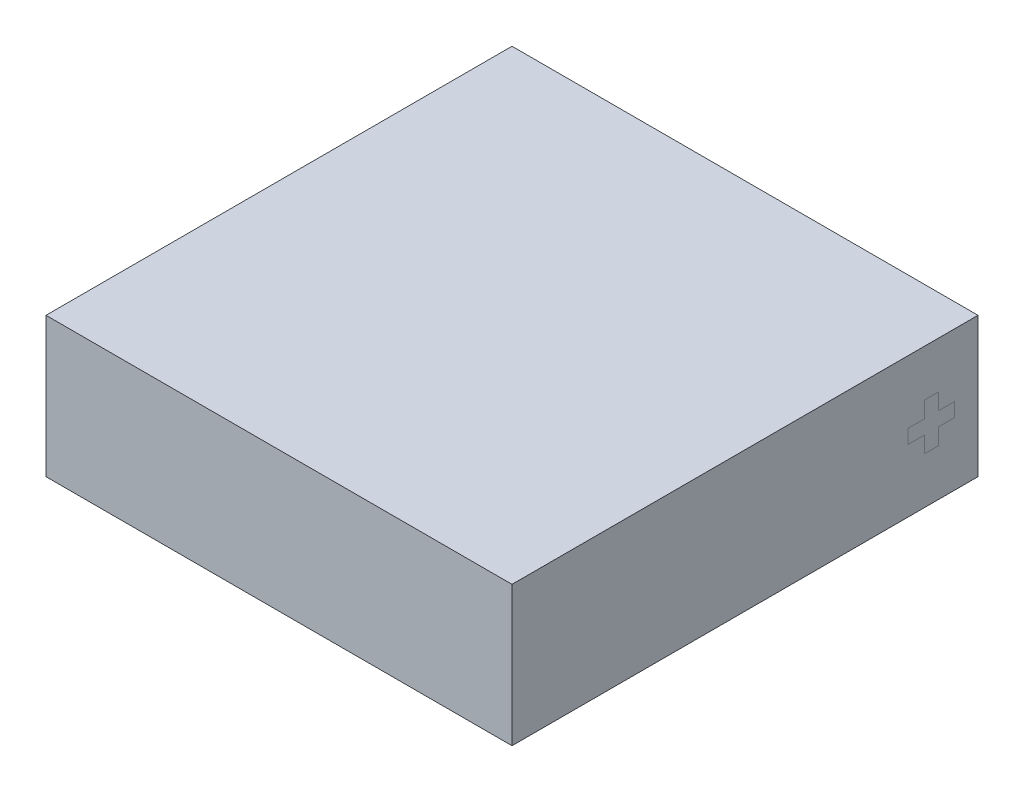
ISO-10303-21;
HEADER;
FILE_DESCRIPTION(('STEP AP214'),'2;1');
FILE_NAME('part.step','',(''),(''),'','','');
FILE_SCHEMA(('AUTOMOTIVE_DESIGN { 1 0 10303 214 1 1 1 1 }'));
ENDSEC;
DATA;
#1=APPLICATION_CONTEXT('core data for automotive mechanical design processes');
#2=APPLICATION_PROTOCOL_DEFINITION('international standard','automotive_design',2000,#1);
#3=PRODUCT_CONTEXT('',#1,'mechanical');
#4=PRODUCT('Part','Part','',(#3));
#5=PRODUCT_RELATED_PRODUCT_CATEGORY('part','',(#4));
#6=PRODUCT_DEFINITION_FORMATION('','',#4);
#7=PRODUCT_DEFINITION_CONTEXT('part definition',#1,'design');
#8=PRODUCT_DEFINITION('design','',#6,#7);
#9=PRODUCT_DEFINITION_SHAPE('','',#8);
#10=(LENGTH_UNIT() NAMED_UNIT(*) SI_UNIT(.MILLI.,.METRE.));
#11=(NAMED_UNIT(*) PLANE_ANGLE_UNIT() SI_UNIT($,.RADIAN.));
#12=(NAMED_UNIT(*) SI_UNIT($,.STERADIAN.) SOLID_ANGLE_UNIT());
#13=UNCERTAINTY_MEASURE_WITH_UNIT(LENGTH_MEASURE(1.E-05),#10,'distance_accuracy_value','');
#14=(GEOMETRIC_REPRESENTATION_CONTEXT(3) GLOBAL_UNCERTAINTY_ASSIGNED_CONTEXT((#13)) GLOBAL_UNIT_ASSIGNED_CONTEXT((#10,
#11,#12)) REPRESENTATION_CONTEXT('',''));
#15=CARTESIAN_POINT('',(0.,0.,0.));
#16=DIRECTION('',(0.,0.,1.));
#17=DIRECTION('',(1.,0.,0.));
#18=AXIS2_PLACEMENT_3D('',#15,#16,#17);
#19=CARTESIAN_POINT('',(5.,3.,-5.));
#20=DIRECTION('',(-1.,0.,0.));
#21=DIRECTION('',(0.,0.,1.));
#22=AXIS2_PLACEMENT_3D('',#19,#20,#21);
#23=PLANE('',#22);
#24=DIRECTION('',(0.,1.,0.));
#25=VECTOR('',#24,1.);
#26=CARTESIAN_POINT('',(5.,1.35,-4.15));
#27=LINE('',#26,#25);
#28=CARTESIAN_POINT('',(5.,0.999999999999999,-4.15));
#29=VERTEX_POINT('',#28);
#30=CARTESIAN_POINT('',(5.,1.35,-4.15));
#31=VERTEX_POINT('',#30);
#32=EDGE_CURVE('E445',#29,#31,#27,.T.);
#33=ORIENTED_EDGE('',*,*,#32,.T.);
#34=DIRECTION('',(0.,0.,-1.));
#35=VECTOR('',#34,1.);
#36=CARTESIAN_POINT('',(5.,1.35,-4.15));
#37=LINE('',#36,#35);
#38=CARTESIAN_POINT('',(5.,1.35,-4.5));
#39=VERTEX_POINT('',#38);
#40=EDGE_CURVE('E13',#31,#39,#37,.T.);
#41=ORIENTED_EDGE('',*,*,#40,.T.);
#42=DIRECTION('',(0.,1.,0.));
#43=VECTOR('',#42,1.);
#44=CARTESIAN_POINT('',(5.,1.65,-4.5));
#45=LINE('',#44,#43);
#46=CARTESIAN_POINT('',(5.,1.65,-4.5));
#47=VERTEX_POINT('',#46);
#48=EDGE_CURVE('E357',#39,#47,#45,.T.);
#49=ORIENTED_EDGE('',*,*,#48,.T.);
#50=DIRECTION('',(0.,0.,1.));
#51=VECTOR('',#50,1.);
#52=CARTESIAN_POINT('',(5.,1.65,-4.15));
#53=LINE('',#52,#51);
#54=CARTESIAN_POINT('',(5.,1.65,-4.15));
#55=VERTEX_POINT('',#54);
#56=EDGE_CURVE('E477',#47,#55,#53,.T.);
#57=ORIENTED_EDGE('',*,*,#56,.T.);
#58=DIRECTION('',(0.,1.,0.));
#59=VECTOR('',#58,1.);
#60=CARTESIAN_POINT('',(5.,2.,-4.15));
#61=LINE('',#60,#59);
#62=CARTESIAN_POINT('',(5.,2.,-4.15));
#63=VERTEX_POINT('',#62);
#64=EDGE_CURVE('E474',#55,#63,#61,.T.);
#65=ORIENTED_EDGE('',*,*,#64,.T.);
#66=DIRECTION('',(0.,0.,1.));
#67=VECTOR('',#66,1.);
#68=CARTESIAN_POINT('',(5.,2.,-3.85));
#69=LINE('',#68,#67);
#70=CARTESIAN_POINT('',(5.,2.,-3.85));
#71=VERTEX_POINT('',#70);
#72=EDGE_CURVE('E471',#63,#71,#69,.T.);
#73=ORIENTED_EDGE('',*,*,#72,.T.);
#74=DIRECTION('',(0.,-1.,0.));
#75=VECTOR('',#74,1.);
#76=CARTESIAN_POINT('',(5.,2.,-3.85));
#77=LINE('',#76,#75);
#78=CARTESIAN_POINT('',(5.,1.65,-3.85));
#79=VERTEX_POINT('',#78);
#80=EDGE_CURVE('E468',#71,#79,#77,.T.);
#81=ORIENTED_EDGE('',*,*,#80,.T.);
#82=DIRECTION('',(0.,0.,1.));
#83=VECTOR('',#82,1.);
#84=CARTESIAN_POINT('',(5.,1.65,-3.5));
#85=LINE('',#84,#83);
#86=CARTESIAN_POINT('',(5.,1.65,-3.5));
#87=VERTEX_POINT('',#86);
#88=EDGE_CURVE('E465',#79,#87,#85,.T.);
#89=ORIENTED_EDGE('',*,*,#88,.T.);
#90=DIRECTION('',(0.,-1.,0.));
#91=VECTOR('',#90,1.);
#92=CARTESIAN_POINT('',(5.,1.65,-3.5));
#93=LINE('',#92,#91);
#94=CARTESIAN_POINT('',(5.,1.35,-3.5));
#95=VERTEX_POINT('',#94);
#96=EDGE_CURVE('E462',#87,#95,#93,.T.);
#97=ORIENTED_EDGE('',*,*,#96,.T.);
#98=DIRECTION('',(0.,0.,-1.));
#99=VECTOR('',#98,1.);
#100=CARTESIAN_POINT('',(5.,1.35,-3.5));
#101=LINE('',#100,#99);
#102=CARTESIAN_POINT('',(5.,1.35,-3.85));
#103=VERTEX_POINT('',#102);
#104=EDGE_CURVE('E459',#95,#103,#101,.T.);
#105=ORIENTED_EDGE('',*,*,#104,.T.);
#106=DIRECTION('',(0.,-1.,0.));
#107=VECTOR('',#106,1.);
#108=CARTESIAN_POINT('',(5.,1.35,-3.85));
#109=LINE('',#108,#107);
#110=CARTESIAN_POINT('',(5.,0.999999999999999,-3.85));
#111=VERTEX_POINT('',#110);
#112=EDGE_CURVE('E456',#103,#111,#109,.T.);
#113=ORIENTED_EDGE('',*,*,#112,.T.);
#114=DIRECTION('',(0.,0.,-1.));
#115=VECTOR('',#114,1.);
#116=CARTESIAN_POINT('',(5.,0.999999999999999,-3.85));
#117=LINE('',#116,#115);
#118=EDGE_CURVE('E448',#111,#29,#117,.T.);
#119=ORIENTED_EDGE('',*,*,#118,.T.);
#120=EDGE_LOOP('',(#33,#41,#49,#57,#65,#73,#81,#89,#97,#105,#113,#119));
#121=FACE_BOUND('',#120,.T.);
#122=ADVANCED_FACE('F348',(#121),#23,.F.);
#123=CARTESIAN_POINT('',(-5.,3.,-5.));
#124=DIRECTION('',(1.,0.,0.));
#125=DIRECTION('',(0.,0.,-1.));
#126=AXIS2_PLACEMENT_3D('',#123,#124,#125);
#127=PLANE('',#126);
#128=DIRECTION('',(0.,0.,1.));
#129=VECTOR('',#128,1.);
#130=CARTESIAN_POINT('',(-5.,0.,-5.));
#131=LINE('',#130,#129);
#132=CARTESIAN_POINT('',(-5.,0.,-5.));
#133=VERTEX_POINT('',#132);
#134=CARTESIAN_POINT('',(-5.,0.,5.));
#135=VERTEX_POINT('',#134);
#136=EDGE_CURVE('E444',#133,#135,#131,.T.);
#137=ORIENTED_EDGE('',*,*,#136,.T.);
#138=DIRECTION('',(0.,-1.,0.));
#139=VECTOR('',#138,1.);
#140=CARTESIAN_POINT('',(-5.,3.,5.));
#141=LINE('',#140,#139);
#142=CARTESIAN_POINT('',(-5.,3.,5.));
#143=VERTEX_POINT('',#142);
#144=EDGE_CURVE('E425',#143,#135,#141,.T.);
#145=ORIENTED_EDGE('',*,*,#144,.F.);
#146=DIRECTION('',(0.,0.,1.));
#147=VECTOR('',#146,1.);
#148=CARTESIAN_POINT('',(-5.,3.,-5.));
#149=LINE('',#148,#147);
#150=CARTESIAN_POINT('',(-5.,3.,-5.));
#151=VERTEX_POINT('',#150);
#152=EDGE_CURVE('E432',#151,#143,#149,.T.);
#153=ORIENTED_EDGE('',*,*,#152,.F.);
#154=DIRECTION('',(0.,-1.,0.));
#155=VECTOR('',#154,1.);
#156=CARTESIAN_POINT('',(-5.,3.,-5.));
#157=LINE('',#156,#155);
#158=EDGE_CURVE('E528',#151,#133,#157,.T.);
#159=ORIENTED_EDGE('',*,*,#158,.T.);
#160=EDGE_LOOP('',(#137,#145,#153,#159));
#161=FACE_BOUND('',#160,.T.);
#162=ADVANCED_FACE('F350',(#161),#127,.F.);
#163=CARTESIAN_POINT('',(-5.,3.,5.));
#164=DIRECTION('',(0.,0.,-1.));
#165=DIRECTION('',(-1.,0.,0.));
#166=AXIS2_PLACEMENT_3D('',#163,#164,#165);
#167=PLANE('',#166);
#168=DIRECTION('',(1.,0.,0.));
#169=VECTOR('',#168,1.);
#170=CARTESIAN_POINT('',(-5.,0.,5.));
#171=LINE('',#170,#169);
#172=CARTESIAN_POINT('',(5.,0.,5.));
#173=VERTEX_POINT('',#172);
#174=EDGE_CURVE('E525',#135,#173,#171,.T.);
#175=ORIENTED_EDGE('',*,*,#174,.T.);
#176=DIRECTION('',(0.,-1.,0.));
#177=VECTOR('',#176,1.);
#178=CARTESIAN_POINT('',(5.,3.,5.));
#179=LINE('',#178,#177);
#180=CARTESIAN_POINT('',(5.,3.,5.));
#181=VERTEX_POINT('',#180);
#182=EDGE_CURVE('E428',#181,#173,#179,.T.);
#183=ORIENTED_EDGE('',*,*,#182,.F.);
#184=DIRECTION('',(1.,0.,0.));
#185=VECTOR('',#184,1.);
#186=CARTESIAN_POINT('',(-5.,3.,5.));
#187=LINE('',#186,#185);
#188=EDGE_CURVE('E421',#143,#181,#187,.T.);
#189=ORIENTED_EDGE('',*,*,#188,.F.);
#190=ORIENTED_EDGE('',*,*,#144,.T.);
#191=EDGE_LOOP('',(#175,#183,#189,#190));
#192=FACE_BOUND('',#191,.T.);
#193=ADVANCED_FACE('F423',(#192),#167,.F.);
#194=ORIENTED_EDGE('',*,*,#40,.F.);
#195=ORIENTED_EDGE('',*,*,#32,.F.);
#196=ORIENTED_EDGE('',*,*,#118,.F.);
#197=ORIENTED_EDGE('',*,*,#112,.F.);
#198=ORIENTED_EDGE('',*,*,#104,.F.);
#199=ORIENTED_EDGE('',*,*,#96,.F.);
#200=ORIENTED_EDGE('',*,*,#88,.F.);
#201=ORIENTED_EDGE('',*,*,#80,.F.);
#202=ORIENTED_EDGE('',*,*,#72,.F.);
#203=ORIENTED_EDGE('',*,*,#64,.F.);
#204=ORIENTED_EDGE('',*,*,#56,.F.);
#205=ORIENTED_EDGE('',*,*,#48,.F.);
#206=EDGE_LOOP('',(#194,#195,#196,#197,#198,#199,#200,#201,#202,#203,#204,#205));
#207=FACE_BOUND('',#206,.T.);
#208=DIRECTION('',(0.,0.,-1.));
#209=VECTOR('',#208,1.);
#210=CARTESIAN_POINT('',(5.,0.,-5.));
#211=LINE('',#210,#209);
#212=CARTESIAN_POINT('',(5.,0.,-5.));
#213=VERTEX_POINT('',#212);
#214=EDGE_CURVE('E521',#173,#213,#211,.T.);
#215=ORIENTED_EDGE('',*,*,#214,.T.);
#216=DIRECTION('',(0.,-1.,0.));
#217=VECTOR('',#216,1.);
#218=CARTESIAN_POINT('',(5.,3.,-5.));
#219=LINE('',#218,#217);
#220=CARTESIAN_POINT('',(5.,3.,-5.));
#221=VERTEX_POINT('',#220);
#222=EDGE_CURVE('E450',#221,#213,#219,.T.);
#223=ORIENTED_EDGE('',*,*,#222,.F.);
#224=DIRECTION('',(0.,0.,-1.));
#225=VECTOR('',#224,1.);
#226=CARTESIAN_POINT('',(5.,3.,-5.));
#227=LINE('',#226,#225);
#228=EDGE_CURVE('E431',#181,#221,#227,.T.);
#229=ORIENTED_EDGE('',*,*,#228,.F.);
#230=ORIENTED_EDGE('',*,*,#182,.T.);
#231=EDGE_LOOP('',(#215,#223,#229,#230));
#232=FACE_BOUND('',#231,.T.);
#233=ADVANCED_FACE('F507',(#207,#232),#23,.F.);
#234=CARTESIAN_POINT('',(-5.,3.,-5.));
#235=DIRECTION('',(0.,0.,1.));
#236=DIRECTION('',(1.,0.,0.));
#237=AXIS2_PLACEMENT_3D('',#234,#235,#236);
#238=PLANE('',#237);
#239=DIRECTION('',(-1.,0.,0.));
#240=VECTOR('',#239,1.);
#241=CARTESIAN_POINT('',(-5.,0.,-5.));
#242=LINE('',#241,#240);
#243=EDGE_CURVE('E441',#213,#133,#242,.T.);
#244=ORIENTED_EDGE('',*,*,#243,.T.);
#245=ORIENTED_EDGE('',*,*,#158,.F.);
#246=DIRECTION('',(-1.,0.,0.));
#247=VECTOR('',#246,1.);
#248=CARTESIAN_POINT('',(-5.,3.,-5.));
#249=LINE('',#248,#247);
#250=EDGE_CURVE('E437',#221,#151,#249,.T.);
#251=ORIENTED_EDGE('',*,*,#250,.F.);
#252=ORIENTED_EDGE('',*,*,#222,.T.);
#253=EDGE_LOOP('',(#244,#245,#251,#252));
#254=FACE_BOUND('',#253,.T.);
#255=ADVANCED_FACE('F517',(#254),#238,.F.);
#256=CARTESIAN_POINT('',(0.,3.,0.));
#257=DIRECTION('',(0.,1.,0.));
#258=DIRECTION('',(0.,0.,1.));
#259=AXIS2_PLACEMENT_3D('',#256,#257,#258);
#260=PLANE('',#259);
#261=ORIENTED_EDGE('',*,*,#152,.T.);
#262=ORIENTED_EDGE('',*,*,#188,.T.);
#263=ORIENTED_EDGE('',*,*,#228,.T.);
#264=ORIENTED_EDGE('',*,*,#250,.T.);
#265=EDGE_LOOP('',(#261,#262,#263,#264));
#266=FACE_BOUND('',#265,.T.);
#267=ADVANCED_FACE('F435',(#266),#260,.T.);
#268=CARTESIAN_POINT('',(0.,0.,0.));
#269=DIRECTION('',(0.,1.,0.));
#270=DIRECTION('',(0.,0.,1.));
#271=AXIS2_PLACEMENT_3D('',#268,#269,#270);
#272=PLANE('',#271);
#273=ORIENTED_EDGE('',*,*,#136,.F.);
#274=ORIENTED_EDGE('',*,*,#243,.F.);
#275=ORIENTED_EDGE('',*,*,#214,.F.);
#276=ORIENTED_EDGE('',*,*,#174,.F.);
#277=EDGE_LOOP('',(#273,#274,#275,#276));
#278=FACE_BOUND('',#277,.T.);
#279=ADVANCED_FACE('F529',(#278),#272,.F.);
#280=CLOSED_SHELL('',(#122,#162,#193,#233,#255,#267,#279));
#281=MANIFOLD_SOLID_BREP('B2',#280);
#282=ADVANCED_BREP_SHAPE_REPRESENTATION('',(#18,#281),#14);
#283=SHAPE_DEFINITION_REPRESENTATION(#9,#282);
ENDSEC;
END-ISO-10303-21;
